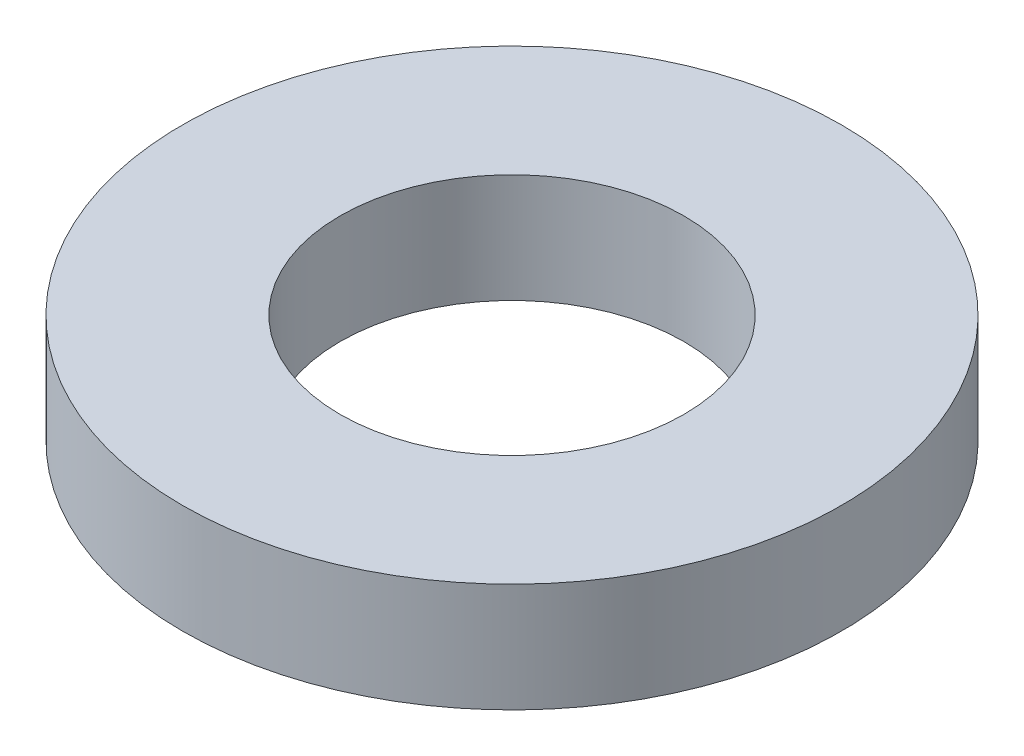
ISO-10303-21;
HEADER;
FILE_DESCRIPTION(('STEP AP214'),'2;1');
FILE_NAME('part.step','',(''),(''),'','','');
FILE_SCHEMA(('AUTOMOTIVE_DESIGN { 1 0 10303 214 1 1 1 1 }'));
ENDSEC;
DATA;
#1=APPLICATION_CONTEXT('core data for automotive mechanical design processes');
#2=APPLICATION_PROTOCOL_DEFINITION('international standard','automotive_design',2000,#1);
#3=PRODUCT_CONTEXT('',#1,'mechanical');
#4=PRODUCT('Part','Part','',(#3));
#5=PRODUCT_RELATED_PRODUCT_CATEGORY('part','',(#4));
#6=PRODUCT_DEFINITION_FORMATION('','',#4);
#7=PRODUCT_DEFINITION_CONTEXT('part definition',#1,'design');
#8=PRODUCT_DEFINITION('design','',#6,#7);
#9=PRODUCT_DEFINITION_SHAPE('','',#8);
#10=(LENGTH_UNIT() NAMED_UNIT(*) SI_UNIT(.MILLI.,.METRE.));
#11=(NAMED_UNIT(*) PLANE_ANGLE_UNIT() SI_UNIT($,.RADIAN.));
#12=(NAMED_UNIT(*) SI_UNIT($,.STERADIAN.) SOLID_ANGLE_UNIT());
#13=UNCERTAINTY_MEASURE_WITH_UNIT(LENGTH_MEASURE(1.E-05),#10,'distance_accuracy_value','');
#14=(GEOMETRIC_REPRESENTATION_CONTEXT(3) GLOBAL_UNCERTAINTY_ASSIGNED_CONTEXT((#13)) GLOBAL_UNIT_ASSIGNED_CONTEXT((#10,
#11,#12)) REPRESENTATION_CONTEXT('',''));
#15=CARTESIAN_POINT('',(0.,0.,0.));
#16=DIRECTION('',(0.,0.,1.));
#17=DIRECTION('',(1.,0.,0.));
#18=AXIS2_PLACEMENT_3D('',#15,#16,#17);
#19=CARTESIAN_POINT('',(0.,19.,0.));
#20=DIRECTION('',(0.,-1.,0.));
#21=DIRECTION('',(0.,0.,-1.));
#22=AXIS2_PLACEMENT_3D('',#19,#20,#21);
#23=CYLINDRICAL_SURFACE('',#22,57.5);
#24=CARTESIAN_POINT('',(0.,19.,0.));
#25=DIRECTION('',(0.,1.,0.));
#26=DIRECTION('',(0.,0.,1.));
#27=AXIS2_PLACEMENT_3D('',#24,#25,#26);
#28=CIRCLE('',#27,57.5);
#29=CARTESIAN_POINT('',(0.,19.,57.5));
#30=VERTEX_POINT('',#29);
#31=EDGE_CURVE('E10',#30,#30,#28,.T.);
#32=ORIENTED_EDGE('',*,*,#31,.F.);
#33=EDGE_LOOP('',(#32));
#34=FACE_BOUND('',#33,.T.);
#35=CARTESIAN_POINT('',(0.,0.,0.));
#36=DIRECTION('',(0.,1.,0.));
#37=DIRECTION('',(0.,0.,1.));
#38=AXIS2_PLACEMENT_3D('',#35,#36,#37);
#39=CIRCLE('',#38,57.5);
#40=CARTESIAN_POINT('',(0.,0.,57.5));
#41=VERTEX_POINT('',#40);
#42=EDGE_CURVE('E37',#41,#41,#39,.T.);
#43=ORIENTED_EDGE('',*,*,#42,.T.);
#44=EDGE_LOOP('',(#43));
#45=FACE_BOUND('',#44,.T.);
#46=ADVANCED_FACE('F40',(#34,#45),#23,.T.);
#47=CARTESIAN_POINT('',(0.,19.,0.));
#48=DIRECTION('',(0.,1.,0.));
#49=DIRECTION('',(0.,0.,1.));
#50=AXIS2_PLACEMENT_3D('',#47,#48,#49);
#51=PLANE('',#50);
#52=CARTESIAN_POINT('',(0.,19.,0.));
#53=DIRECTION('',(0.,1.,0.));
#54=DIRECTION('',(0.,0.,1.));
#55=AXIS2_PLACEMENT_3D('',#52,#53,#54);
#56=CIRCLE('',#55,30.);
#57=CARTESIAN_POINT('',(0.,19.,30.));
#58=VERTEX_POINT('',#57);
#59=EDGE_CURVE('E50',#58,#58,#56,.T.);
#60=ORIENTED_EDGE('',*,*,#59,.F.);
#61=EDGE_LOOP('',(#60));
#62=FACE_BOUND('',#61,.T.);
#63=ORIENTED_EDGE('',*,*,#31,.T.);
#64=EDGE_LOOP('',(#63));
#65=FACE_BOUND('',#64,.T.);
#66=ADVANCED_FACE('F59',(#62,#65),#51,.T.);
#67=CARTESIAN_POINT('',(0.,0.,0.));
#68=DIRECTION('',(0.,1.,0.));
#69=DIRECTION('',(0.,0.,1.));
#70=AXIS2_PLACEMENT_3D('',#67,#68,#69);
#71=PLANE('',#70);
#72=CARTESIAN_POINT('',(0.,0.,0.));
#73=DIRECTION('',(0.,1.,0.));
#74=DIRECTION('',(0.,0.,1.));
#75=AXIS2_PLACEMENT_3D('',#72,#73,#74);
#76=CIRCLE('',#75,30.);
#77=CARTESIAN_POINT('',(0.,0.,30.));
#78=VERTEX_POINT('',#77);
#79=EDGE_CURVE('E47',#78,#78,#76,.T.);
#80=ORIENTED_EDGE('',*,*,#79,.T.);
#81=EDGE_LOOP('',(#80));
#82=FACE_BOUND('',#81,.T.);
#83=ORIENTED_EDGE('',*,*,#42,.F.);
#84=EDGE_LOOP('',(#83));
#85=FACE_BOUND('',#84,.T.);
#86=ADVANCED_FACE('F58',(#82,#85),#71,.F.);
#87=CARTESIAN_POINT('',(0.,19.,0.));
#88=DIRECTION('',(0.,-1.,0.));
#89=DIRECTION('',(0.,0.,-1.));
#90=AXIS2_PLACEMENT_3D('',#87,#88,#89);
#91=CYLINDRICAL_SURFACE('',#90,30.);
#92=ORIENTED_EDGE('',*,*,#59,.T.);
#93=EDGE_LOOP('',(#92));
#94=FACE_BOUND('',#93,.T.);
#95=ORIENTED_EDGE('',*,*,#79,.F.);
#96=EDGE_LOOP('',(#95));
#97=FACE_BOUND('',#96,.T.);
#98=ADVANCED_FACE('F54',(#94,#97),#91,.F.);
#99=CLOSED_SHELL('',(#46,#66,#86,#98));
#100=MANIFOLD_SOLID_BREP('B2',#99);
#101=ADVANCED_BREP_SHAPE_REPRESENTATION('',(#18,#100),#14);
#102=SHAPE_DEFINITION_REPRESENTATION(#9,#101);
ENDSEC;
END-ISO-10303-21;
